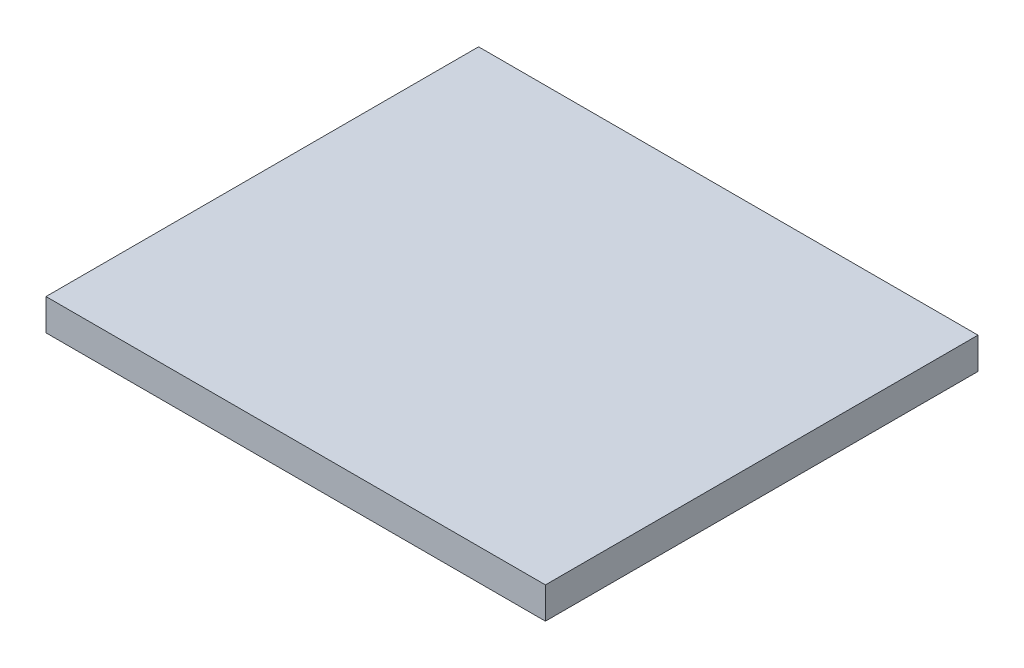
ISO-10303-21;
HEADER;
FILE_DESCRIPTION(('STEP AP214'),'2;1');
FILE_NAME('part.step','',(''),(''),'','','');
FILE_SCHEMA(('AUTOMOTIVE_DESIGN { 1 0 10303 214 1 1 1 1 }'));
ENDSEC;
DATA;
#1=APPLICATION_CONTEXT('core data for automotive mechanical design processes');
#2=APPLICATION_PROTOCOL_DEFINITION('international standard','automotive_design',2000,#1);
#3=PRODUCT_CONTEXT('',#1,'mechanical');
#4=PRODUCT('Part','Part','',(#3));
#5=PRODUCT_RELATED_PRODUCT_CATEGORY('part','',(#4));
#6=PRODUCT_DEFINITION_FORMATION('','',#4);
#7=PRODUCT_DEFINITION_CONTEXT('part definition',#1,'design');
#8=PRODUCT_DEFINITION('design','',#6,#7);
#9=PRODUCT_DEFINITION_SHAPE('','',#8);
#10=(LENGTH_UNIT() NAMED_UNIT(*) SI_UNIT(.MILLI.,.METRE.));
#11=(NAMED_UNIT(*) PLANE_ANGLE_UNIT() SI_UNIT($,.RADIAN.));
#12=(NAMED_UNIT(*) SI_UNIT($,.STERADIAN.) SOLID_ANGLE_UNIT());
#13=UNCERTAINTY_MEASURE_WITH_UNIT(LENGTH_MEASURE(1.E-05),#10,'distance_accuracy_value','');
#14=(GEOMETRIC_REPRESENTATION_CONTEXT(3) GLOBAL_UNCERTAINTY_ASSIGNED_CONTEXT((#13)) GLOBAL_UNIT_ASSIGNED_CONTEXT((#10,
#11,#12)) REPRESENTATION_CONTEXT('',''));
#15=CARTESIAN_POINT('',(0.,0.,0.));
#16=DIRECTION('',(0.,0.,1.));
#17=DIRECTION('',(1.,0.,0.));
#18=AXIS2_PLACEMENT_3D('',#15,#16,#17);
#19=CARTESIAN_POINT('',(0.,0.,88.));
#20=DIRECTION('',(1.,0.,0.));
#21=DIRECTION('',(0.,0.,-1.));
#22=AXIS2_PLACEMENT_3D('',#19,#20,#21);
#23=PLANE('',#22);
#24=DIRECTION('',(0.,-1.,0.));
#25=VECTOR('',#24,1.);
#26=CARTESIAN_POINT('',(0.,0.,0.));
#27=LINE('',#26,#25);
#28=CARTESIAN_POINT('',(0.,6.4,0.));
#29=VERTEX_POINT('',#28);
#30=CARTESIAN_POINT('',(0.,0.,0.));
#31=VERTEX_POINT('',#30);
#32=EDGE_CURVE('E109',#29,#31,#27,.T.);
#33=ORIENTED_EDGE('',*,*,#32,.T.);
#34=DIRECTION('',(0.,0.,-1.));
#35=VECTOR('',#34,1.);
#36=CARTESIAN_POINT('',(0.,0.,88.));
#37=LINE('',#36,#35);
#38=CARTESIAN_POINT('',(0.,0.,88.));
#39=VERTEX_POINT('',#38);
#40=EDGE_CURVE('E11',#39,#31,#37,.T.);
#41=ORIENTED_EDGE('',*,*,#40,.F.);
#42=DIRECTION('',(0.,-1.,0.));
#43=VECTOR('',#42,1.);
#44=CARTESIAN_POINT('',(0.,0.,88.));
#45=LINE('',#44,#43);
#46=CARTESIAN_POINT('',(0.,6.4,88.));
#47=VERTEX_POINT('',#46);
#48=EDGE_CURVE('E93',#47,#39,#45,.T.);
#49=ORIENTED_EDGE('',*,*,#48,.F.);
#50=DIRECTION('',(0.,0.,-1.));
#51=VECTOR('',#50,1.);
#52=CARTESIAN_POINT('',(0.,6.4,88.));
#53=LINE('',#52,#51);
#54=EDGE_CURVE('E105',#47,#29,#53,.T.);
#55=ORIENTED_EDGE('',*,*,#54,.T.);
#56=EDGE_LOOP('',(#33,#41,#49,#55));
#57=FACE_BOUND('',#56,.T.);
#58=ADVANCED_FACE('F41',(#57),#23,.F.);
#59=CARTESIAN_POINT('',(0.,0.,88.));
#60=DIRECTION('',(0.,1.,0.));
#61=DIRECTION('',(0.,0.,1.));
#62=AXIS2_PLACEMENT_3D('',#59,#60,#61);
#63=PLANE('',#62);
#64=DIRECTION('',(1.,0.,0.));
#65=VECTOR('',#64,1.);
#66=CARTESIAN_POINT('',(0.,0.,0.));
#67=LINE('',#66,#65);
#68=CARTESIAN_POINT('',(101.6,0.,0.));
#69=VERTEX_POINT('',#68);
#70=EDGE_CURVE('E98',#31,#69,#67,.T.);
#71=ORIENTED_EDGE('',*,*,#70,.T.);
#72=DIRECTION('',(0.,0.,-1.));
#73=VECTOR('',#72,1.);
#74=CARTESIAN_POINT('',(101.6,0.,88.));
#75=LINE('',#74,#73);
#76=CARTESIAN_POINT('',(101.6,0.,88.));
#77=VERTEX_POINT('',#76);
#78=EDGE_CURVE('E50',#77,#69,#75,.T.);
#79=ORIENTED_EDGE('',*,*,#78,.F.);
#80=DIRECTION('',(1.,0.,0.));
#81=VECTOR('',#80,1.);
#82=CARTESIAN_POINT('',(0.,0.,88.));
#83=LINE('',#82,#81);
#84=EDGE_CURVE('E88',#39,#77,#83,.T.);
#85=ORIENTED_EDGE('',*,*,#84,.F.);
#86=ORIENTED_EDGE('',*,*,#40,.T.);
#87=EDGE_LOOP('',(#71,#79,#85,#86));
#88=FACE_BOUND('',#87,.T.);
#89=ADVANCED_FACE('F97',(#88),#63,.F.);
#90=CARTESIAN_POINT('',(101.6,0.,88.));
#91=DIRECTION('',(-1.,0.,0.));
#92=DIRECTION('',(0.,0.,1.));
#93=AXIS2_PLACEMENT_3D('',#90,#91,#92);
#94=PLANE('',#93);
#95=DIRECTION('',(0.,1.,0.));
#96=VECTOR('',#95,1.);
#97=CARTESIAN_POINT('',(101.6,0.,0.));
#98=LINE('',#97,#96);
#99=CARTESIAN_POINT('',(101.6,6.4,0.));
#100=VERTEX_POINT('',#99);
#101=EDGE_CURVE('E75',#69,#100,#98,.T.);
#102=ORIENTED_EDGE('',*,*,#101,.T.);
#103=DIRECTION('',(0.,0.,-1.));
#104=VECTOR('',#103,1.);
#105=CARTESIAN_POINT('',(101.6,6.4,88.));
#106=LINE('',#105,#104);
#107=CARTESIAN_POINT('',(101.6,6.4,88.));
#108=VERTEX_POINT('',#107);
#109=EDGE_CURVE('E100',#108,#100,#106,.T.);
#110=ORIENTED_EDGE('',*,*,#109,.F.);
#111=DIRECTION('',(0.,1.,0.));
#112=VECTOR('',#111,1.);
#113=CARTESIAN_POINT('',(101.6,0.,88.));
#114=LINE('',#113,#112);
#115=EDGE_CURVE('E91',#77,#108,#114,.T.);
#116=ORIENTED_EDGE('',*,*,#115,.F.);
#117=ORIENTED_EDGE('',*,*,#78,.T.);
#118=EDGE_LOOP('',(#102,#110,#116,#117));
#119=FACE_BOUND('',#118,.T.);
#120=ADVANCED_FACE('F101',(#119),#94,.F.);
#121=CARTESIAN_POINT('',(0.,6.4,88.));
#122=DIRECTION('',(0.,-1.,0.));
#123=DIRECTION('',(0.,0.,-1.));
#124=AXIS2_PLACEMENT_3D('',#121,#122,#123);
#125=PLANE('',#124);
#126=DIRECTION('',(-1.,0.,0.));
#127=VECTOR('',#126,1.);
#128=CARTESIAN_POINT('',(0.,6.4,0.));
#129=LINE('',#128,#127);
#130=EDGE_CURVE('E81',#100,#29,#129,.T.);
#131=ORIENTED_EDGE('',*,*,#130,.T.);
#132=ORIENTED_EDGE('',*,*,#54,.F.);
#133=DIRECTION('',(-1.,0.,0.));
#134=VECTOR('',#133,1.);
#135=CARTESIAN_POINT('',(0.,6.4,88.));
#136=LINE('',#135,#134);
#137=EDGE_CURVE('E58',#108,#47,#136,.T.);
#138=ORIENTED_EDGE('',*,*,#137,.F.);
#139=ORIENTED_EDGE('',*,*,#109,.T.);
#140=EDGE_LOOP('',(#131,#132,#138,#139));
#141=FACE_BOUND('',#140,.T.);
#142=ADVANCED_FACE('F122',(#141),#125,.F.);
#143=CARTESIAN_POINT('',(0.,0.,88.));
#144=DIRECTION('',(0.,0.,-1.));
#145=DIRECTION('',(-1.,0.,0.));
#146=AXIS2_PLACEMENT_3D('',#143,#144,#145);
#147=PLANE('',#146);
#148=ORIENTED_EDGE('',*,*,#48,.T.);
#149=ORIENTED_EDGE('',*,*,#84,.T.);
#150=ORIENTED_EDGE('',*,*,#115,.T.);
#151=ORIENTED_EDGE('',*,*,#137,.T.);
#152=EDGE_LOOP('',(#148,#149,#150,#151));
#153=FACE_BOUND('',#152,.T.);
#154=ADVANCED_FACE('F89',(#153),#147,.F.);
#155=CARTESIAN_POINT('',(0.,0.,0.));
#156=DIRECTION('',(0.,0.,-1.));
#157=DIRECTION('',(-1.,0.,0.));
#158=AXIS2_PLACEMENT_3D('',#155,#156,#157);
#159=PLANE('',#158);
#160=ORIENTED_EDGE('',*,*,#32,.F.);
#161=ORIENTED_EDGE('',*,*,#130,.F.);
#162=ORIENTED_EDGE('',*,*,#101,.F.);
#163=ORIENTED_EDGE('',*,*,#70,.F.);
#164=EDGE_LOOP('',(#160,#161,#162,#163));
#165=FACE_BOUND('',#164,.T.);
#166=ADVANCED_FACE('F125',(#165),#159,.T.);
#167=CLOSED_SHELL('',(#58,#89,#120,#142,#154,#166));
#168=MANIFOLD_SOLID_BREP('B2',#167);
#169=ADVANCED_BREP_SHAPE_REPRESENTATION('',(#18,#168),#14);
#170=SHAPE_DEFINITION_REPRESENTATION(#9,#169);
ENDSEC;
END-ISO-10303-21;
